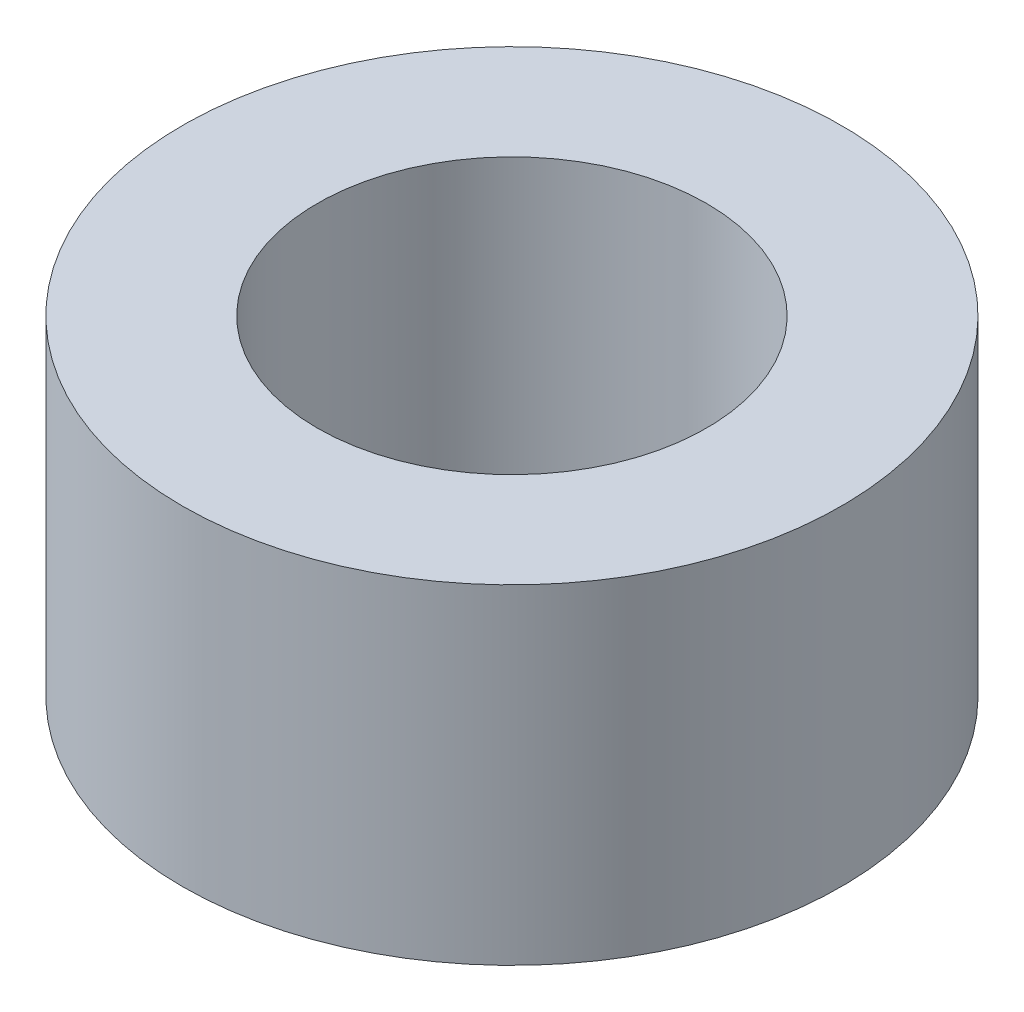
ISO-10303-21;
HEADER;
FILE_DESCRIPTION(('STEP AP214'),'2;1');
FILE_NAME('part.step','',(''),(''),'','','');
FILE_SCHEMA(('AUTOMOTIVE_DESIGN { 1 0 10303 214 1 1 1 1 }'));
ENDSEC;
DATA;
#1=APPLICATION_CONTEXT('core data for automotive mechanical design processes');
#2=APPLICATION_PROTOCOL_DEFINITION('international standard','automotive_design',2000,#1);
#3=PRODUCT_CONTEXT('',#1,'mechanical');
#4=PRODUCT('Part','Part','',(#3));
#5=PRODUCT_RELATED_PRODUCT_CATEGORY('part','',(#4));
#6=PRODUCT_DEFINITION_FORMATION('','',#4);
#7=PRODUCT_DEFINITION_CONTEXT('part definition',#1,'design');
#8=PRODUCT_DEFINITION('design','',#6,#7);
#9=PRODUCT_DEFINITION_SHAPE('','',#8);
#10=(LENGTH_UNIT() NAMED_UNIT(*) SI_UNIT(.MILLI.,.METRE.));
#11=(NAMED_UNIT(*) PLANE_ANGLE_UNIT() SI_UNIT($,.RADIAN.));
#12=(NAMED_UNIT(*) SI_UNIT($,.STERADIAN.) SOLID_ANGLE_UNIT());
#13=UNCERTAINTY_MEASURE_WITH_UNIT(LENGTH_MEASURE(1.E-05),#10,'distance_accuracy_value','');
#14=(GEOMETRIC_REPRESENTATION_CONTEXT(3) GLOBAL_UNCERTAINTY_ASSIGNED_CONTEXT((#13)) GLOBAL_UNIT_ASSIGNED_CONTEXT((#10,
#11,#12)) REPRESENTATION_CONTEXT('',''));
#15=CARTESIAN_POINT('',(0.,0.,0.));
#16=DIRECTION('',(0.,0.,1.));
#17=DIRECTION('',(1.,0.,0.));
#18=AXIS2_PLACEMENT_3D('',#15,#16,#17);
#19=CARTESIAN_POINT('',(0.,6.35,0.));
#20=DIRECTION('',(0.,1.,0.));
#21=DIRECTION('',(0.,0.,1.));
#22=AXIS2_PLACEMENT_3D('',#19,#20,#21);
#23=PLANE('',#22);
#24=CARTESIAN_POINT('',(0.,6.35,0.));
#25=DIRECTION('',(0.,1.,0.));
#26=DIRECTION('',(0.,0.,1.));
#27=AXIS2_PLACEMENT_3D('',#24,#25,#26);
#28=CIRCLE('',#27,6.35);
#29=CARTESIAN_POINT('',(0.,6.35,6.35));
#30=VERTEX_POINT('',#29);
#31=EDGE_CURVE('E10',#30,#30,#28,.T.);
#32=ORIENTED_EDGE('',*,*,#31,.T.);
#33=EDGE_LOOP('',(#32));
#34=FACE_BOUND('',#33,.T.);
#35=CARTESIAN_POINT('',(0.,6.35,0.));
#36=DIRECTION('',(0.,1.,0.));
#37=DIRECTION('',(0.,0.,1.));
#38=AXIS2_PLACEMENT_3D('',#35,#36,#37);
#39=CIRCLE('',#38,3.75);
#40=CARTESIAN_POINT('',(0.,6.35,3.75));
#41=VERTEX_POINT('',#40);
#42=EDGE_CURVE('E25',#41,#41,#39,.T.);
#43=ORIENTED_EDGE('',*,*,#42,.F.);
#44=EDGE_LOOP('',(#43));
#45=FACE_BOUND('',#44,.T.);
#46=ADVANCED_FACE('F14',(#34,#45),#23,.T.);
#47=CARTESIAN_POINT('',(0.,0.,0.));
#48=DIRECTION('',(0.,1.,0.));
#49=DIRECTION('',(0.,0.,1.));
#50=AXIS2_PLACEMENT_3D('',#47,#48,#49);
#51=PLANE('',#50);
#52=CARTESIAN_POINT('',(0.,0.,0.));
#53=DIRECTION('',(0.,1.,0.));
#54=DIRECTION('',(0.,0.,1.));
#55=AXIS2_PLACEMENT_3D('',#52,#53,#54);
#56=CIRCLE('',#55,6.35);
#57=CARTESIAN_POINT('',(0.,0.,6.35));
#58=VERTEX_POINT('',#57);
#59=EDGE_CURVE('E18',#58,#58,#56,.T.);
#60=ORIENTED_EDGE('',*,*,#59,.F.);
#61=EDGE_LOOP('',(#60));
#62=FACE_BOUND('',#61,.T.);
#63=CARTESIAN_POINT('',(0.,0.,0.));
#64=DIRECTION('',(0.,1.,0.));
#65=DIRECTION('',(0.,0.,1.));
#66=AXIS2_PLACEMENT_3D('',#63,#64,#65);
#67=CIRCLE('',#66,3.75);
#68=CARTESIAN_POINT('',(0.,0.,3.75));
#69=VERTEX_POINT('',#68);
#70=EDGE_CURVE('E27',#69,#69,#67,.T.);
#71=ORIENTED_EDGE('',*,*,#70,.T.);
#72=EDGE_LOOP('',(#71));
#73=FACE_BOUND('',#72,.T.);
#74=ADVANCED_FACE('F37',(#62,#73),#51,.F.);
#75=CARTESIAN_POINT('',(0.,6.35,0.));
#76=DIRECTION('',(0.,-1.,0.));
#77=DIRECTION('',(0.,0.,-1.));
#78=AXIS2_PLACEMENT_3D('',#75,#76,#77);
#79=CYLINDRICAL_SURFACE('',#78,6.35);
#80=ORIENTED_EDGE('',*,*,#31,.F.);
#81=EDGE_LOOP('',(#80));
#82=FACE_BOUND('',#81,.T.);
#83=ORIENTED_EDGE('',*,*,#59,.T.);
#84=EDGE_LOOP('',(#83));
#85=FACE_BOUND('',#84,.T.);
#86=ADVANCED_FACE('F16',(#82,#85),#79,.T.);
#87=CARTESIAN_POINT('',(0.,6.35,0.));
#88=DIRECTION('',(0.,-1.,0.));
#89=DIRECTION('',(0.,0.,-1.));
#90=AXIS2_PLACEMENT_3D('',#87,#88,#89);
#91=CYLINDRICAL_SURFACE('',#90,3.75);
#92=ORIENTED_EDGE('',*,*,#42,.T.);
#93=EDGE_LOOP('',(#92));
#94=FACE_BOUND('',#93,.T.);
#95=ORIENTED_EDGE('',*,*,#70,.F.);
#96=EDGE_LOOP('',(#95));
#97=FACE_BOUND('',#96,.T.);
#98=ADVANCED_FACE('F33',(#94,#97),#91,.F.);
#99=CLOSED_SHELL('',(#46,#74,#86,#98));
#100=MANIFOLD_SOLID_BREP('B1',#99);
#101=ADVANCED_BREP_SHAPE_REPRESENTATION('',(#18,#100),#14);
#102=SHAPE_DEFINITION_REPRESENTATION(#9,#101);
ENDSEC;
END-ISO-10303-21;
